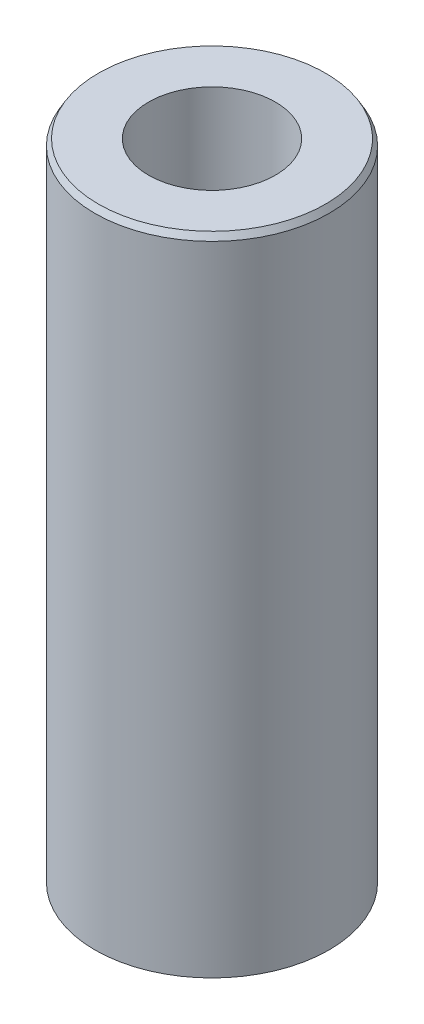
ISO-10303-21;
HEADER;
FILE_DESCRIPTION(('STEP AP214'),'2;1');
FILE_NAME('part.step','',(''),(''),'','','');
FILE_SCHEMA(('AUTOMOTIVE_DESIGN { 1 0 10303 214 1 1 1 1 }'));
ENDSEC;
DATA;
#1=APPLICATION_CONTEXT('core data for automotive mechanical design processes');
#2=APPLICATION_PROTOCOL_DEFINITION('international standard','automotive_design',2000,#1);
#3=PRODUCT_CONTEXT('',#1,'mechanical');
#4=PRODUCT('Part','Part','',(#3));
#5=PRODUCT_RELATED_PRODUCT_CATEGORY('part','',(#4));
#6=PRODUCT_DEFINITION_FORMATION('','',#4);
#7=PRODUCT_DEFINITION_CONTEXT('part definition',#1,'design');
#8=PRODUCT_DEFINITION('design','',#6,#7);
#9=PRODUCT_DEFINITION_SHAPE('','',#8);
#10=(LENGTH_UNIT() NAMED_UNIT(*) SI_UNIT(.MILLI.,.METRE.));
#11=(NAMED_UNIT(*) PLANE_ANGLE_UNIT() SI_UNIT($,.RADIAN.));
#12=(NAMED_UNIT(*) SI_UNIT($,.STERADIAN.) SOLID_ANGLE_UNIT());
#13=UNCERTAINTY_MEASURE_WITH_UNIT(LENGTH_MEASURE(1.E-05),#10,'distance_accuracy_value','');
#14=(GEOMETRIC_REPRESENTATION_CONTEXT(3) GLOBAL_UNCERTAINTY_ASSIGNED_CONTEXT((#13)) GLOBAL_UNIT_ASSIGNED_CONTEXT((#10,
#11,#12)) REPRESENTATION_CONTEXT('',''));
#15=CARTESIAN_POINT('',(0.,0.,0.));
#16=DIRECTION('',(0.,0.,1.));
#17=DIRECTION('',(1.,0.,0.));
#18=AXIS2_PLACEMENT_3D('',#15,#16,#17);
#19=CARTESIAN_POINT('',(0.,290.363429526187,0.));
#20=DIRECTION('',(0.,-1.,0.));
#21=DIRECTION('',(0.,0.,-1.));
#22=AXIS2_PLACEMENT_3D('',#19,#20,#21);
#23=CYLINDRICAL_SURFACE('',#22,52.5);
#24=CARTESIAN_POINT('',(0.,287.573983619624,0.));
#25=DIRECTION('',(0.,1.,0.));
#26=DIRECTION('',(0.,0.,1.));
#27=AXIS2_PLACEMENT_3D('',#24,#25,#26);
#28=CIRCLE('',#27,52.5);
#29=CARTESIAN_POINT('',(0.,287.573983619624,52.5));
#30=VERTEX_POINT('',#29);
#31=EDGE_CURVE('E50',#30,#30,#28,.F.);
#32=ORIENTED_EDGE('',*,*,#31,.T.);
#33=EDGE_LOOP('',(#32));
#34=FACE_BOUND('',#33,.T.);
#35=CARTESIAN_POINT('',(0.,1.61048734504415,0.));
#36=DIRECTION('',(0.,1.,0.));
#37=DIRECTION('',(0.,0.,1.));
#38=AXIS2_PLACEMENT_3D('',#35,#36,#37);
#39=CIRCLE('',#38,52.5);
#40=CARTESIAN_POINT('',(0.,1.61048734504415,52.5));
#41=VERTEX_POINT('',#40);
#42=EDGE_CURVE('E51',#41,#41,#39,.T.);
#43=ORIENTED_EDGE('',*,*,#42,.T.);
#44=EDGE_LOOP('',(#43));
#45=FACE_BOUND('',#44,.T.);
#46=ADVANCED_FACE('F39',(#34,#45),#23,.T.);
#47=CARTESIAN_POINT('',(0.,290.363429526187,0.));
#48=DIRECTION('',(0.,1.,0.));
#49=DIRECTION('',(0.,0.,1.));
#50=AXIS2_PLACEMENT_3D('',#47,#48,#49);
#51=PLANE('',#50);
#52=CARTESIAN_POINT('',(0.,290.363429526187,0.));
#53=DIRECTION('',(0.,1.,0.));
#54=DIRECTION('',(0.,0.,1.));
#55=AXIS2_PLACEMENT_3D('',#52,#53,#54);
#56=CIRCLE('',#55,50.8895126549558);
#57=CARTESIAN_POINT('',(0.,290.363429526187,50.8895126549558));
#58=VERTEX_POINT('',#57);
#59=EDGE_CURVE('E54',#58,#58,#56,.T.);
#60=ORIENTED_EDGE('',*,*,#59,.T.);
#61=EDGE_LOOP('',(#60));
#62=FACE_BOUND('',#61,.T.);
#63=CARTESIAN_POINT('',(0.,290.363429526187,0.));
#64=DIRECTION('',(0.,1.,0.));
#65=DIRECTION('',(0.,0.,1.));
#66=AXIS2_PLACEMENT_3D('',#63,#64,#65);
#67=CIRCLE('',#66,28.4374433111562);
#68=CARTESIAN_POINT('',(0.,290.363429526187,28.4374433111562));
#69=VERTEX_POINT('',#68);
#70=EDGE_CURVE('E58',#69,#69,#67,.T.);
#71=ORIENTED_EDGE('',*,*,#70,.F.);
#72=EDGE_LOOP('',(#71));
#73=FACE_BOUND('',#72,.T.);
#74=ADVANCED_FACE('F69',(#62,#73),#51,.T.);
#75=CARTESIAN_POINT('',(0.,0.,0.));
#76=DIRECTION('',(0.,1.,0.));
#77=DIRECTION('',(0.,0.,1.));
#78=AXIS2_PLACEMENT_3D('',#75,#76,#77);
#79=PLANE('',#78);
#80=CARTESIAN_POINT('',(0.,0.,0.));
#81=DIRECTION('',(0.,1.,0.));
#82=DIRECTION('',(0.,0.,1.));
#83=AXIS2_PLACEMENT_3D('',#80,#81,#82);
#84=CIRCLE('',#83,49.7105540934367);
#85=CARTESIAN_POINT('',(0.,0.,49.7105540934367));
#86=VERTEX_POINT('',#85);
#87=EDGE_CURVE('E10',#86,#86,#84,.F.);
#88=ORIENTED_EDGE('',*,*,#87,.T.);
#89=EDGE_LOOP('',(#88));
#90=FACE_BOUND('',#89,.T.);
#91=CARTESIAN_POINT('',(0.,0.,0.));
#92=DIRECTION('',(0.,1.,0.));
#93=DIRECTION('',(0.,0.,1.));
#94=AXIS2_PLACEMENT_3D('',#91,#92,#93);
#95=CIRCLE('',#94,28.4374433111562);
#96=CARTESIAN_POINT('',(0.,0.,28.4374433111562));
#97=VERTEX_POINT('',#96);
#98=EDGE_CURVE('E63',#97,#97,#95,.T.);
#99=ORIENTED_EDGE('',*,*,#98,.T.);
#100=EDGE_LOOP('',(#99));
#101=FACE_BOUND('',#100,.T.);
#102=ADVANCED_FACE('F75',(#90,#101),#79,.F.);
#103=CARTESIAN_POINT('',(0.,290.363429526187,0.));
#104=DIRECTION('',(0.,-1.,0.));
#105=DIRECTION('',(0.,0.,-1.));
#106=AXIS2_PLACEMENT_3D('',#103,#104,#105);
#107=CYLINDRICAL_SURFACE('',#106,28.4374433111562);
#108=ORIENTED_EDGE('',*,*,#70,.T.);
#109=EDGE_LOOP('',(#108));
#110=FACE_BOUND('',#109,.T.);
#111=ORIENTED_EDGE('',*,*,#98,.F.);
#112=EDGE_LOOP('',(#111));
#113=FACE_BOUND('',#112,.T.);
#114=ADVANCED_FACE('F70',(#110,#113),#107,.F.);
#115=CARTESIAN_POINT('',(0.,290.363429526187,0.));
#116=DIRECTION('',(0.,-1.,0.));
#117=DIRECTION('',(0.,0.,-1.));
#118=AXIS2_PLACEMENT_3D('',#115,#116,#117);
#119=CONICAL_SURFACE('',#118,50.8895126549558,0.523598775598295);
#120=ORIENTED_EDGE('',*,*,#31,.F.);
#121=EDGE_LOOP('',(#120));
#122=FACE_BOUND('',#121,.T.);
#123=ORIENTED_EDGE('',*,*,#59,.F.);
#124=EDGE_LOOP('',(#123));
#125=FACE_BOUND('',#124,.T.);
#126=ADVANCED_FACE('F81',(#122,#125),#119,.T.);
#127=CARTESIAN_POINT('',(0.,1.61048734504415,0.));
#128=DIRECTION('',(0.,1.,0.));
#129=DIRECTION('',(0.,0.,1.));
#130=AXIS2_PLACEMENT_3D('',#127,#128,#129);
#131=CONICAL_SURFACE('',#130,52.5,1.04719755119661);
#132=ORIENTED_EDGE('',*,*,#87,.F.);
#133=EDGE_LOOP('',(#132));
#134=FACE_BOUND('',#133,.T.);
#135=ORIENTED_EDGE('',*,*,#42,.F.);
#136=EDGE_LOOP('',(#135));
#137=FACE_BOUND('',#136,.T.);
#138=ADVANCED_FACE('F45',(#134,#137),#131,.T.);
#139=CLOSED_SHELL('',(#46,#74,#102,#114,#126,#138));
#140=MANIFOLD_SOLID_BREP('B2',#139);
#141=ADVANCED_BREP_SHAPE_REPRESENTATION('',(#18,#140),#14);
#142=SHAPE_DEFINITION_REPRESENTATION(#9,#141);
ENDSEC;
END-ISO-10303-21;
